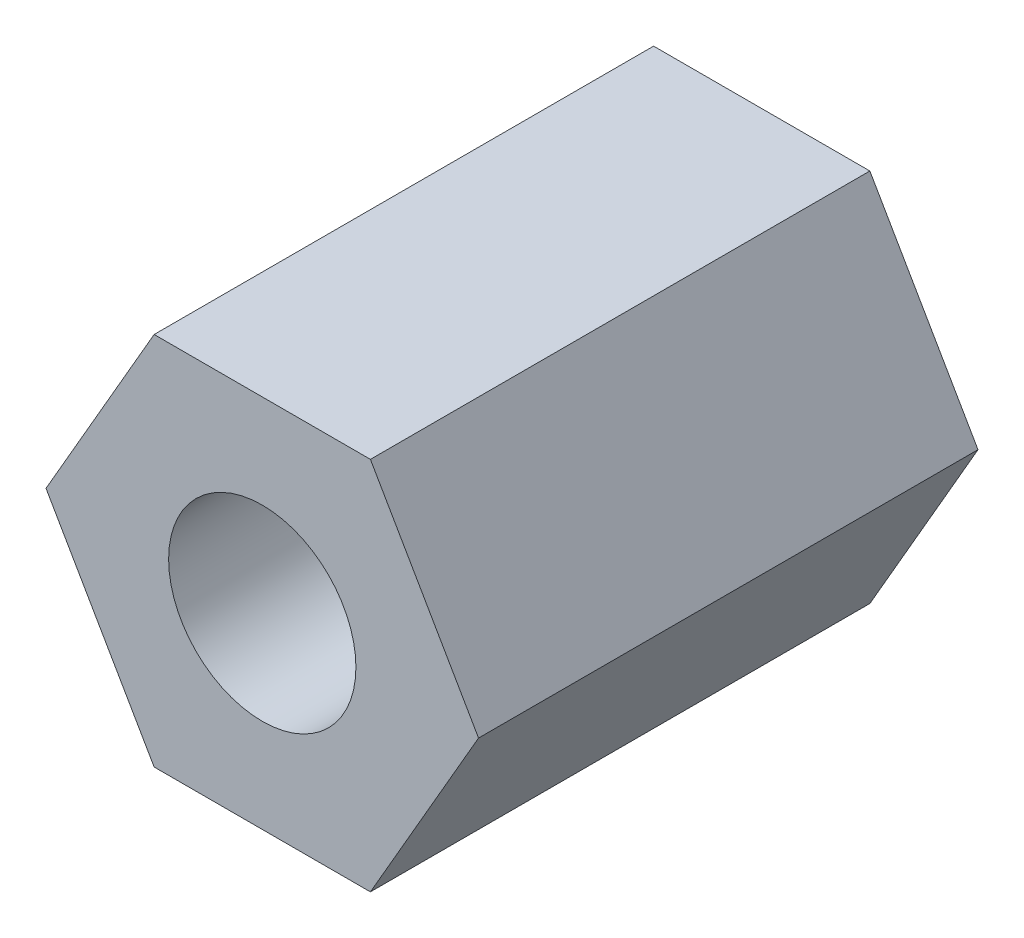
ISO-10303-21;
HEADER;
FILE_DESCRIPTION(('STEP AP214'),'2;1');
FILE_NAME('part.step','',(''),(''),'','','');
FILE_SCHEMA(('AUTOMOTIVE_DESIGN { 1 0 10303 214 1 1 1 1 }'));
ENDSEC;
DATA;
#1=APPLICATION_CONTEXT('core data for automotive mechanical design processes');
#2=APPLICATION_PROTOCOL_DEFINITION('international standard','automotive_design',2000,#1);
#3=PRODUCT_CONTEXT('',#1,'mechanical');
#4=PRODUCT('Part','Part','',(#3));
#5=PRODUCT_RELATED_PRODUCT_CATEGORY('part','',(#4));
#6=PRODUCT_DEFINITION_FORMATION('','',#4);
#7=PRODUCT_DEFINITION_CONTEXT('part definition',#1,'design');
#8=PRODUCT_DEFINITION('design','',#6,#7);
#9=PRODUCT_DEFINITION_SHAPE('','',#8);
#10=(LENGTH_UNIT() NAMED_UNIT(*) SI_UNIT(.MILLI.,.METRE.));
#11=(NAMED_UNIT(*) PLANE_ANGLE_UNIT() SI_UNIT($,.RADIAN.));
#12=(NAMED_UNIT(*) SI_UNIT($,.STERADIAN.) SOLID_ANGLE_UNIT());
#13=UNCERTAINTY_MEASURE_WITH_UNIT(LENGTH_MEASURE(1.E-05),#10,'distance_accuracy_value','');
#14=(GEOMETRIC_REPRESENTATION_CONTEXT(3) GLOBAL_UNCERTAINTY_ASSIGNED_CONTEXT((#13)) GLOBAL_UNIT_ASSIGNED_CONTEXT((#10,
#11,#12)) REPRESENTATION_CONTEXT('',''));
#15=CARTESIAN_POINT('',(0.,0.,0.));
#16=DIRECTION('',(0.,0.,1.));
#17=DIRECTION('',(1.,0.,0.));
#18=AXIS2_PLACEMENT_3D('',#15,#16,#17);
#19=CARTESIAN_POINT('',(0.,0.,8.));
#20=DIRECTION('',(0.,0.,1.));
#21=DIRECTION('',(1.,0.,0.));
#22=AXIS2_PLACEMENT_3D('',#19,#20,#21);
#23=PLANE('',#22);
#24=DIRECTION('',(-0.5,0.866025403784438,0.));
#25=VECTOR('',#24,1.);
#26=CARTESIAN_POINT('',(3.46410161513775,0.,8.));
#27=LINE('',#26,#25);
#28=CARTESIAN_POINT('',(3.46410161513775,0.,8.));
#29=VERTEX_POINT('',#28);
#30=CARTESIAN_POINT('',(1.73205080756888,3.,8.));
#31=VERTEX_POINT('',#30);
#32=EDGE_CURVE('E148',#29,#31,#27,.T.);
#33=ORIENTED_EDGE('',*,*,#32,.T.);
#34=DIRECTION('',(-1.,0.,0.));
#35=VECTOR('',#34,1.);
#36=CARTESIAN_POINT('',(1.73205080756888,3.,8.));
#37=LINE('',#36,#35);
#38=CARTESIAN_POINT('',(-1.73205080756888,3.,8.));
#39=VERTEX_POINT('',#38);
#40=EDGE_CURVE('E96',#31,#39,#37,.T.);
#41=ORIENTED_EDGE('',*,*,#40,.T.);
#42=DIRECTION('',(-0.499999999999999,-0.866025403784439,0.));
#43=VECTOR('',#42,1.);
#44=CARTESIAN_POINT('',(-1.73205080756888,3.,8.));
#45=LINE('',#44,#43);
#46=CARTESIAN_POINT('',(-3.46410161513775,0.,8.));
#47=VERTEX_POINT('',#46);
#48=EDGE_CURVE('E109',#39,#47,#45,.T.);
#49=ORIENTED_EDGE('',*,*,#48,.T.);
#50=DIRECTION('',(0.500000000000001,-0.866025403784438,0.));
#51=VECTOR('',#50,1.);
#52=CARTESIAN_POINT('',(-3.46410161513775,0.,8.));
#53=LINE('',#52,#51);
#54=CARTESIAN_POINT('',(-1.73205080756887,-3.,8.));
#55=VERTEX_POINT('',#54);
#56=EDGE_CURVE('E103',#47,#55,#53,.T.);
#57=ORIENTED_EDGE('',*,*,#56,.T.);
#58=DIRECTION('',(1.,0.,0.));
#59=VECTOR('',#58,1.);
#60=CARTESIAN_POINT('',(-1.73205080756887,-3.,8.));
#61=LINE('',#60,#59);
#62=CARTESIAN_POINT('',(1.73205080756888,-3.,8.));
#63=VERTEX_POINT('',#62);
#64=EDGE_CURVE('E107',#55,#63,#61,.T.);
#65=ORIENTED_EDGE('',*,*,#64,.T.);
#66=DIRECTION('',(0.499999999999999,0.866025403784439,0.));
#67=VECTOR('',#66,1.);
#68=CARTESIAN_POINT('',(1.73205080756888,-3.,8.));
#69=LINE('',#68,#67);
#70=EDGE_CURVE('E59',#63,#29,#69,.T.);
#71=ORIENTED_EDGE('',*,*,#70,.T.);
#72=EDGE_LOOP('',(#33,#41,#49,#57,#65,#71));
#73=FACE_BOUND('',#72,.T.);
#74=CARTESIAN_POINT('',(0.,0.,8.));
#75=DIRECTION('',(0.,0.,1.));
#76=DIRECTION('',(1.,0.,0.));
#77=AXIS2_PLACEMENT_3D('',#74,#75,#76);
#78=CIRCLE('',#77,1.5);
#79=CARTESIAN_POINT('',(1.5,0.,8.));
#80=VERTEX_POINT('',#79);
#81=EDGE_CURVE('E136',#80,#80,#78,.T.);
#82=ORIENTED_EDGE('',*,*,#81,.F.);
#83=EDGE_LOOP('',(#82));
#84=FACE_BOUND('',#83,.T.);
#85=ADVANCED_FACE('F41',(#73,#84),#23,.T.);
#86=CARTESIAN_POINT('',(0.,0.,0.));
#87=DIRECTION('',(0.,0.,1.));
#88=DIRECTION('',(1.,0.,0.));
#89=AXIS2_PLACEMENT_3D('',#86,#87,#88);
#90=PLANE('',#89);
#91=DIRECTION('',(-0.5,0.866025403784438,0.));
#92=VECTOR('',#91,1.);
#93=CARTESIAN_POINT('',(3.46410161513775,0.,0.));
#94=LINE('',#93,#92);
#95=CARTESIAN_POINT('',(3.46410161513775,0.,0.));
#96=VERTEX_POINT('',#95);
#97=CARTESIAN_POINT('',(1.73205080756888,3.,0.));
#98=VERTEX_POINT('',#97);
#99=EDGE_CURVE('E131',#96,#98,#94,.T.);
#100=ORIENTED_EDGE('',*,*,#99,.F.);
#101=DIRECTION('',(0.499999999999999,0.866025403784439,0.));
#102=VECTOR('',#101,1.);
#103=CARTESIAN_POINT('',(1.73205080756888,-3.,0.));
#104=LINE('',#103,#102);
#105=CARTESIAN_POINT('',(1.73205080756888,-3.,0.));
#106=VERTEX_POINT('',#105);
#107=EDGE_CURVE('E88',#106,#96,#104,.T.);
#108=ORIENTED_EDGE('',*,*,#107,.F.);
#109=DIRECTION('',(1.,0.,0.));
#110=VECTOR('',#109,1.);
#111=CARTESIAN_POINT('',(-1.73205080756887,-3.,0.));
#112=LINE('',#111,#110);
#113=CARTESIAN_POINT('',(-1.73205080756887,-3.,0.));
#114=VERTEX_POINT('',#113);
#115=EDGE_CURVE('E82',#114,#106,#112,.T.);
#116=ORIENTED_EDGE('',*,*,#115,.F.);
#117=DIRECTION('',(0.500000000000001,-0.866025403784438,0.));
#118=VECTOR('',#117,1.);
#119=CARTESIAN_POINT('',(-3.46410161513775,0.,0.));
#120=LINE('',#119,#118);
#121=CARTESIAN_POINT('',(-3.46410161513775,0.,0.));
#122=VERTEX_POINT('',#121);
#123=EDGE_CURVE('E118',#122,#114,#120,.T.);
#124=ORIENTED_EDGE('',*,*,#123,.F.);
#125=DIRECTION('',(-0.499999999999999,-0.866025403784439,0.));
#126=VECTOR('',#125,1.);
#127=CARTESIAN_POINT('',(-1.73205080756888,3.,0.));
#128=LINE('',#127,#126);
#129=CARTESIAN_POINT('',(-1.73205080756888,3.,0.));
#130=VERTEX_POINT('',#129);
#131=EDGE_CURVE('E139',#130,#122,#128,.T.);
#132=ORIENTED_EDGE('',*,*,#131,.F.);
#133=DIRECTION('',(-1.,0.,0.));
#134=VECTOR('',#133,1.);
#135=CARTESIAN_POINT('',(1.73205080756888,3.,0.));
#136=LINE('',#135,#134);
#137=EDGE_CURVE('E135',#98,#130,#136,.T.);
#138=ORIENTED_EDGE('',*,*,#137,.F.);
#139=EDGE_LOOP('',(#100,#108,#116,#124,#132,#138));
#140=FACE_BOUND('',#139,.T.);
#141=CARTESIAN_POINT('',(0.,0.,0.));
#142=DIRECTION('',(0.,0.,1.));
#143=DIRECTION('',(1.,0.,0.));
#144=AXIS2_PLACEMENT_3D('',#141,#142,#143);
#145=CIRCLE('',#144,1.5);
#146=CARTESIAN_POINT('',(1.5,0.,0.));
#147=VERTEX_POINT('',#146);
#148=EDGE_CURVE('E245',#147,#147,#145,.T.);
#149=ORIENTED_EDGE('',*,*,#148,.T.);
#150=EDGE_LOOP('',(#149));
#151=FACE_BOUND('',#150,.T.);
#152=ADVANCED_FACE('F161',(#140,#151),#90,.F.);
#153=CARTESIAN_POINT('',(3.46410161513775,0.,8.));
#154=DIRECTION('',(-0.866025403784438,-0.5,0.));
#155=DIRECTION('',(0.5,-0.866025403784439,0.));
#156=AXIS2_PLACEMENT_3D('',#153,#154,#155);
#157=PLANE('',#156);
#158=ORIENTED_EDGE('',*,*,#99,.T.);
#159=DIRECTION('',(0.,0.,-1.));
#160=VECTOR('',#159,1.);
#161=CARTESIAN_POINT('',(1.73205080756888,3.,8.));
#162=LINE('',#161,#160);
#163=EDGE_CURVE('E11',#31,#98,#162,.T.);
#164=ORIENTED_EDGE('',*,*,#163,.F.);
#165=ORIENTED_EDGE('',*,*,#32,.F.);
#166=DIRECTION('',(0.,0.,-1.));
#167=VECTOR('',#166,1.);
#168=CARTESIAN_POINT('',(3.46410161513775,0.,8.));
#169=LINE('',#168,#167);
#170=EDGE_CURVE('E127',#29,#96,#169,.T.);
#171=ORIENTED_EDGE('',*,*,#170,.T.);
#172=EDGE_LOOP('',(#158,#164,#165,#171));
#173=FACE_BOUND('',#172,.T.);
#174=ADVANCED_FACE('F43',(#173),#157,.F.);
#175=CARTESIAN_POINT('',(1.73205080756888,3.,8.));
#176=DIRECTION('',(0.,-1.,0.));
#177=DIRECTION('',(0.,0.,-1.));
#178=AXIS2_PLACEMENT_3D('',#175,#176,#177);
#179=PLANE('',#178);
#180=ORIENTED_EDGE('',*,*,#137,.T.);
#181=DIRECTION('',(0.,0.,-1.));
#182=VECTOR('',#181,1.);
#183=CARTESIAN_POINT('',(-1.73205080756888,3.,8.));
#184=LINE('',#183,#182);
#185=EDGE_CURVE('E51',#39,#130,#184,.T.);
#186=ORIENTED_EDGE('',*,*,#185,.F.);
#187=ORIENTED_EDGE('',*,*,#40,.F.);
#188=ORIENTED_EDGE('',*,*,#163,.T.);
#189=EDGE_LOOP('',(#180,#186,#187,#188));
#190=FACE_BOUND('',#189,.T.);
#191=ADVANCED_FACE('F186',(#190),#179,.F.);
#192=CARTESIAN_POINT('',(-1.73205080756888,3.,8.));
#193=DIRECTION('',(0.866025403784439,-0.5,0.));
#194=DIRECTION('',(0.499999999999999,0.866025403784439,0.));
#195=AXIS2_PLACEMENT_3D('',#192,#193,#194);
#196=PLANE('',#195);
#197=ORIENTED_EDGE('',*,*,#131,.T.);
#198=DIRECTION('',(0.,0.,-1.));
#199=VECTOR('',#198,1.);
#200=CARTESIAN_POINT('',(-3.46410161513775,0.,8.));
#201=LINE('',#200,#199);
#202=EDGE_CURVE('E120',#47,#122,#201,.T.);
#203=ORIENTED_EDGE('',*,*,#202,.F.);
#204=ORIENTED_EDGE('',*,*,#48,.F.);
#205=ORIENTED_EDGE('',*,*,#185,.T.);
#206=EDGE_LOOP('',(#197,#203,#204,#205));
#207=FACE_BOUND('',#206,.T.);
#208=ADVANCED_FACE('F158',(#207),#196,.F.);
#209=CARTESIAN_POINT('',(-3.46410161513775,0.,8.));
#210=DIRECTION('',(0.866025403784438,0.500000000000001,0.));
#211=DIRECTION('',(-0.500000000000001,0.866025403784438,0.));
#212=AXIS2_PLACEMENT_3D('',#209,#210,#211);
#213=PLANE('',#212);
#214=ORIENTED_EDGE('',*,*,#123,.T.);
#215=DIRECTION('',(0.,0.,-1.));
#216=VECTOR('',#215,1.);
#217=CARTESIAN_POINT('',(-1.73205080756887,-3.,8.));
#218=LINE('',#217,#216);
#219=EDGE_CURVE('E115',#55,#114,#218,.T.);
#220=ORIENTED_EDGE('',*,*,#219,.F.);
#221=ORIENTED_EDGE('',*,*,#56,.F.);
#222=ORIENTED_EDGE('',*,*,#202,.T.);
#223=EDGE_LOOP('',(#214,#220,#221,#222));
#224=FACE_BOUND('',#223,.T.);
#225=ADVANCED_FACE('F116',(#224),#213,.F.);
#226=CARTESIAN_POINT('',(-1.73205080756887,-3.,8.));
#227=DIRECTION('',(0.,1.,0.));
#228=DIRECTION('',(-1.,0.,0.));
#229=AXIS2_PLACEMENT_3D('',#226,#227,#228);
#230=PLANE('',#229);
#231=ORIENTED_EDGE('',*,*,#115,.T.);
#232=DIRECTION('',(0.,0.,-1.));
#233=VECTOR('',#232,1.);
#234=CARTESIAN_POINT('',(1.73205080756888,-3.,8.));
#235=LINE('',#234,#233);
#236=EDGE_CURVE('E121',#63,#106,#235,.T.);
#237=ORIENTED_EDGE('',*,*,#236,.F.);
#238=ORIENTED_EDGE('',*,*,#64,.F.);
#239=ORIENTED_EDGE('',*,*,#219,.T.);
#240=EDGE_LOOP('',(#231,#237,#238,#239));
#241=FACE_BOUND('',#240,.T.);
#242=ADVANCED_FACE('F123',(#241),#230,.F.);
#243=CARTESIAN_POINT('',(1.73205080756888,-3.,8.));
#244=DIRECTION('',(-0.866025403784439,0.499999999999999,0.));
#245=DIRECTION('',(-0.499999999999999,-0.866025403784439,0.));
#246=AXIS2_PLACEMENT_3D('',#243,#244,#245);
#247=PLANE('',#246);
#248=ORIENTED_EDGE('',*,*,#107,.T.);
#249=ORIENTED_EDGE('',*,*,#170,.F.);
#250=ORIENTED_EDGE('',*,*,#70,.F.);
#251=ORIENTED_EDGE('',*,*,#236,.T.);
#252=EDGE_LOOP('',(#248,#249,#250,#251));
#253=FACE_BOUND('',#252,.T.);
#254=ADVANCED_FACE('F166',(#253),#247,.F.);
#255=CARTESIAN_POINT('',(0.,0.,8.));
#256=DIRECTION('',(0.,0.,-1.));
#257=DIRECTION('',(-1.,0.,0.));
#258=AXIS2_PLACEMENT_3D('',#255,#256,#257);
#259=CYLINDRICAL_SURFACE('',#258,1.5);
#260=ORIENTED_EDGE('',*,*,#81,.T.);
#261=EDGE_LOOP('',(#260));
#262=FACE_BOUND('',#261,.T.);
#263=ORIENTED_EDGE('',*,*,#148,.F.);
#264=EDGE_LOOP('',(#263));
#265=FACE_BOUND('',#264,.T.);
#266=ADVANCED_FACE('F168',(#262,#265),#259,.F.);
#267=CLOSED_SHELL('',(#85,#152,#174,#191,#208,#225,#242,#254,#266));
#268=MANIFOLD_SOLID_BREP('B2',#267);
#269=ADVANCED_BREP_SHAPE_REPRESENTATION('',(#18,#268),#14);
#270=SHAPE_DEFINITION_REPRESENTATION(#9,#269);
ENDSEC;
END-ISO-10303-21;
